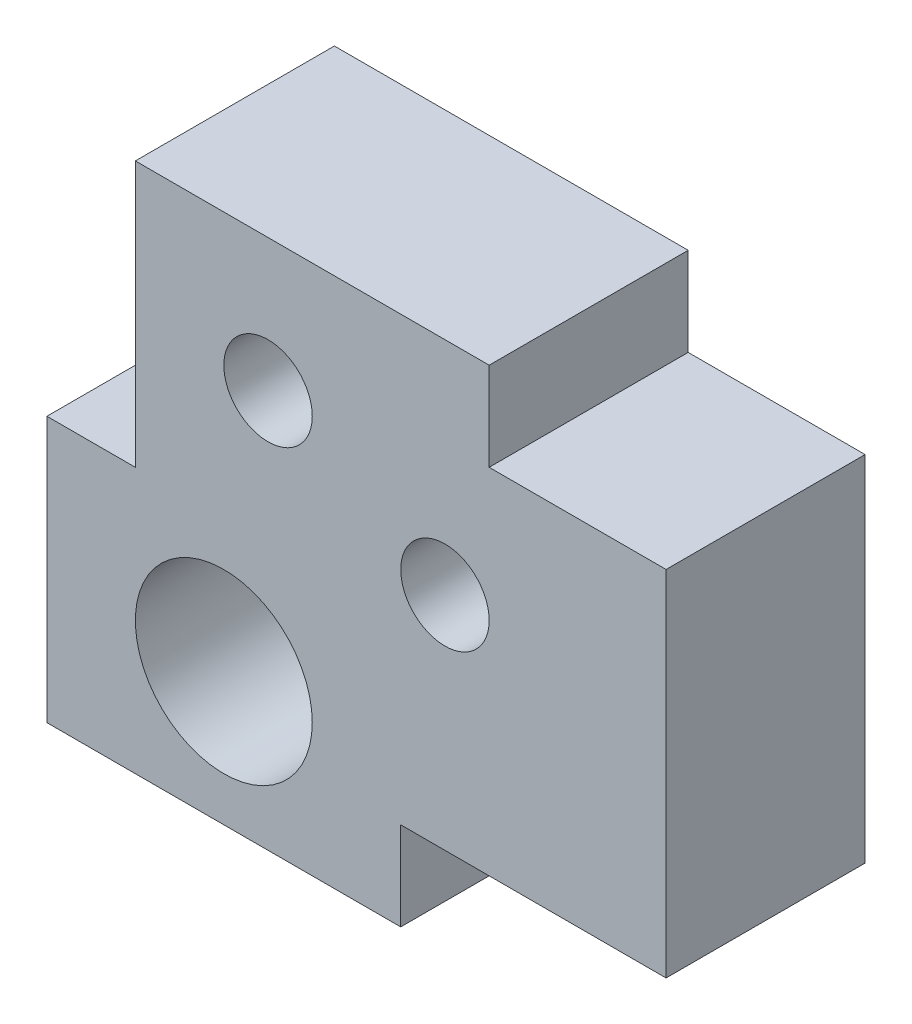
ISO-10303-21;
HEADER;
FILE_DESCRIPTION(('STEP AP214'),'2;1');
FILE_NAME('part.step','',(''),(''),'','','');
FILE_SCHEMA(('AUTOMOTIVE_DESIGN { 1 0 10303 214 1 1 1 1 }'));
ENDSEC;
DATA;
#1=APPLICATION_CONTEXT('core data for automotive mechanical design processes');
#2=APPLICATION_PROTOCOL_DEFINITION('international standard','automotive_design',2000,#1);
#3=PRODUCT_CONTEXT('',#1,'mechanical');
#4=PRODUCT('Part','Part','',(#3));
#5=PRODUCT_RELATED_PRODUCT_CATEGORY('part','',(#4));
#6=PRODUCT_DEFINITION_FORMATION('','',#4);
#7=PRODUCT_DEFINITION_CONTEXT('part definition',#1,'design');
#8=PRODUCT_DEFINITION('design','',#6,#7);
#9=PRODUCT_DEFINITION_SHAPE('','',#8);
#10=(LENGTH_UNIT() NAMED_UNIT(*) SI_UNIT(.MILLI.,.METRE.));
#11=(NAMED_UNIT(*) PLANE_ANGLE_UNIT() SI_UNIT($,.RADIAN.));
#12=(NAMED_UNIT(*) SI_UNIT($,.STERADIAN.) SOLID_ANGLE_UNIT());
#13=UNCERTAINTY_MEASURE_WITH_UNIT(LENGTH_MEASURE(1.E-05),#10,'distance_accuracy_value','');
#14=(GEOMETRIC_REPRESENTATION_CONTEXT(3) GLOBAL_UNCERTAINTY_ASSIGNED_CONTEXT((#13)) GLOBAL_UNIT_ASSIGNED_CONTEXT((#10,
#11,#12)) REPRESENTATION_CONTEXT('',''));
#15=CARTESIAN_POINT('',(0.,0.,0.));
#16=DIRECTION('',(0.,0.,1.));
#17=DIRECTION('',(1.,0.,0.));
#18=AXIS2_PLACEMENT_3D('',#15,#16,#17);
#19=CARTESIAN_POINT('',(0.,0.,28.575));
#20=DIRECTION('',(0.,0.,-1.));
#21=DIRECTION('',(-1.,0.,0.));
#22=AXIS2_PLACEMENT_3D('',#19,#20,#21);
#23=PLANE('',#22);
#24=DIRECTION('',(0.,-1.,0.));
#25=VECTOR('',#24,1.);
#26=CARTESIAN_POINT('',(-12.5135326887395,0.,28.575));
#27=LINE('',#26,#25);
#28=CARTESIAN_POINT('',(-12.5135326887395,38.1,28.575));
#29=VERTEX_POINT('',#28);
#30=CARTESIAN_POINT('',(-12.5135326887395,0.,28.575));
#31=VERTEX_POINT('',#30);
#32=EDGE_CURVE('E197',#29,#31,#27,.T.);
#33=ORIENTED_EDGE('',*,*,#32,.T.);
#34=DIRECTION('',(-1.,0.,0.));
#35=VECTOR('',#34,1.);
#36=CARTESIAN_POINT('',(-12.5135326887395,0.,28.575));
#37=LINE('',#36,#35);
#38=CARTESIAN_POINT('',(-25.2135326887395,0.,28.575));
#39=VERTEX_POINT('',#38);
#40=EDGE_CURVE('E120',#31,#39,#37,.T.);
#41=ORIENTED_EDGE('',*,*,#40,.T.);
#42=DIRECTION('',(0.,-1.,0.));
#43=VECTOR('',#42,1.);
#44=CARTESIAN_POINT('',(-25.2135326887395,0.,28.575));
#45=LINE('',#44,#43);
#46=CARTESIAN_POINT('',(-25.2135326887395,-38.1,28.575));
#47=VERTEX_POINT('',#46);
#48=EDGE_CURVE('E227',#39,#47,#45,.T.);
#49=ORIENTED_EDGE('',*,*,#48,.T.);
#50=DIRECTION('',(1.,0.,0.));
#51=VECTOR('',#50,1.);
#52=CARTESIAN_POINT('',(-25.2135326887395,-38.1,28.575));
#53=LINE('',#52,#51);
#54=CARTESIAN_POINT('',(25.5864673112605,-38.1,28.575));
#55=VERTEX_POINT('',#54);
#56=EDGE_CURVE('E247',#47,#55,#53,.T.);
#57=ORIENTED_EDGE('',*,*,#56,.T.);
#58=DIRECTION('',(0.,1.,0.));
#59=VECTOR('',#58,1.);
#60=CARTESIAN_POINT('',(25.5864673112605,-38.1,28.575));
#61=LINE('',#60,#59);
#62=CARTESIAN_POINT('',(25.5864673112605,-25.4,28.575));
#63=VERTEX_POINT('',#62);
#64=EDGE_CURVE('E243',#55,#63,#61,.T.);
#65=ORIENTED_EDGE('',*,*,#64,.T.);
#66=DIRECTION('',(1.,0.,0.));
#67=VECTOR('',#66,1.);
#68=CARTESIAN_POINT('',(63.6864673112605,-25.4,28.575));
#69=LINE('',#68,#67);
#70=CARTESIAN_POINT('',(63.6864673112605,-25.4,28.575));
#71=VERTEX_POINT('',#70);
#72=EDGE_CURVE('E246',#63,#71,#69,.T.);
#73=ORIENTED_EDGE('',*,*,#72,.T.);
#74=DIRECTION('',(0.,1.,0.));
#75=VECTOR('',#74,1.);
#76=CARTESIAN_POINT('',(63.6864673112605,25.4,28.575));
#77=LINE('',#76,#75);
#78=CARTESIAN_POINT('',(63.6864673112605,25.4,28.575));
#79=VERTEX_POINT('',#78);
#80=EDGE_CURVE('E145',#71,#79,#77,.T.);
#81=ORIENTED_EDGE('',*,*,#80,.T.);
#82=DIRECTION('',(-1.,0.,0.));
#83=VECTOR('',#82,1.);
#84=CARTESIAN_POINT('',(38.2864673112605,25.4,28.575));
#85=LINE('',#84,#83);
#86=CARTESIAN_POINT('',(38.2864673112605,25.4,28.575));
#87=VERTEX_POINT('',#86);
#88=EDGE_CURVE('E139',#79,#87,#85,.T.);
#89=ORIENTED_EDGE('',*,*,#88,.T.);
#90=DIRECTION('',(0.,1.,0.));
#91=VECTOR('',#90,1.);
#92=CARTESIAN_POINT('',(38.2864673112605,38.1,28.575));
#93=LINE('',#92,#91);
#94=CARTESIAN_POINT('',(38.2864673112605,38.1,28.575));
#95=VERTEX_POINT('',#94);
#96=EDGE_CURVE('E143',#87,#95,#93,.T.);
#97=ORIENTED_EDGE('',*,*,#96,.T.);
#98=DIRECTION('',(-1.,0.,0.));
#99=VECTOR('',#98,1.);
#100=CARTESIAN_POINT('',(-12.5135326887395,38.1,28.575));
#101=LINE('',#100,#99);
#102=EDGE_CURVE('E71',#95,#29,#101,.T.);
#103=ORIENTED_EDGE('',*,*,#102,.T.);
#104=EDGE_LOOP('',(#33,#41,#49,#57,#65,#73,#81,#89,#97,#103));
#105=FACE_BOUND('',#104,.T.);
#106=CARTESIAN_POINT('',(6.53646731126052,19.05,28.575));
#107=DIRECTION('',(0.,0.,1.));
#108=DIRECTION('',(1.,0.,0.));
#109=AXIS2_PLACEMENT_3D('',#106,#107,#108);
#110=CIRCLE('',#109,6.35);
#111=CARTESIAN_POINT('',(12.8864673112605,19.05,28.575));
#112=VERTEX_POINT('',#111);
#113=EDGE_CURVE('E173',#112,#112,#110,.T.);
#114=ORIENTED_EDGE('',*,*,#113,.F.);
#115=EDGE_LOOP('',(#114));
#116=FACE_BOUND('',#115,.T.);
#117=CARTESIAN_POINT('',(31.9364673112605,6.35,28.575));
#118=DIRECTION('',(0.,0.,1.));
#119=DIRECTION('',(1.,0.,0.));
#120=AXIS2_PLACEMENT_3D('',#117,#118,#119);
#121=CIRCLE('',#120,6.35);
#122=CARTESIAN_POINT('',(38.2864673112605,6.35,28.575));
#123=VERTEX_POINT('',#122);
#124=EDGE_CURVE('E269',#123,#123,#121,.T.);
#125=ORIENTED_EDGE('',*,*,#124,.F.);
#126=EDGE_LOOP('',(#125));
#127=FACE_BOUND('',#126,.T.);
#128=CARTESIAN_POINT('',(0.186467311260523,-19.05,28.575));
#129=DIRECTION('',(0.,0.,1.));
#130=DIRECTION('',(1.,0.,0.));
#131=AXIS2_PLACEMENT_3D('',#128,#129,#130);
#132=CIRCLE('',#131,12.7);
#133=CARTESIAN_POINT('',(12.8864673112605,-19.05,28.575));
#134=VERTEX_POINT('',#133);
#135=EDGE_CURVE('E277',#134,#134,#132,.T.);
#136=ORIENTED_EDGE('',*,*,#135,.F.);
#137=EDGE_LOOP('',(#136));
#138=FACE_BOUND('',#137,.T.);
#139=ADVANCED_FACE('F53',(#105,#116,#127,#138),#23,.F.);
#140=CARTESIAN_POINT('',(0.,0.,0.));
#141=DIRECTION('',(0.,0.,-1.));
#142=DIRECTION('',(-1.,0.,0.));
#143=AXIS2_PLACEMENT_3D('',#140,#141,#142);
#144=PLANE('',#143);
#145=CARTESIAN_POINT('',(31.9364673112605,6.35,0.));
#146=DIRECTION('',(0.,0.,1.));
#147=DIRECTION('',(1.,0.,0.));
#148=AXIS2_PLACEMENT_3D('',#145,#146,#147);
#149=CIRCLE('',#148,6.35);
#150=CARTESIAN_POINT('',(38.2864673112605,6.35,0.));
#151=VERTEX_POINT('',#150);
#152=EDGE_CURVE('E273',#151,#151,#149,.T.);
#153=ORIENTED_EDGE('',*,*,#152,.T.);
#154=EDGE_LOOP('',(#153));
#155=FACE_BOUND('',#154,.T.);
#156=DIRECTION('',(0.,-1.,0.));
#157=VECTOR('',#156,1.);
#158=CARTESIAN_POINT('',(-12.5135326887395,0.,0.));
#159=LINE('',#158,#157);
#160=CARTESIAN_POINT('',(-12.5135326887395,38.1,0.));
#161=VERTEX_POINT('',#160);
#162=CARTESIAN_POINT('',(-12.5135326887395,0.,0.));
#163=VERTEX_POINT('',#162);
#164=EDGE_CURVE('E168',#161,#163,#159,.T.);
#165=ORIENTED_EDGE('',*,*,#164,.F.);
#166=DIRECTION('',(-1.,0.,0.));
#167=VECTOR('',#166,1.);
#168=CARTESIAN_POINT('',(-12.5135326887395,38.1,0.));
#169=LINE('',#168,#167);
#170=CARTESIAN_POINT('',(38.2864673112605,38.1,0.));
#171=VERTEX_POINT('',#170);
#172=EDGE_CURVE('E112',#171,#161,#169,.T.);
#173=ORIENTED_EDGE('',*,*,#172,.F.);
#174=DIRECTION('',(0.,1.,0.));
#175=VECTOR('',#174,1.);
#176=CARTESIAN_POINT('',(38.2864673112605,38.1,0.));
#177=LINE('',#176,#175);
#178=CARTESIAN_POINT('',(38.2864673112605,25.4,0.));
#179=VERTEX_POINT('',#178);
#180=EDGE_CURVE('E106',#179,#171,#177,.T.);
#181=ORIENTED_EDGE('',*,*,#180,.F.);
#182=DIRECTION('',(-1.,0.,0.));
#183=VECTOR('',#182,1.);
#184=CARTESIAN_POINT('',(38.2864673112605,25.4,0.));
#185=LINE('',#184,#183);
#186=CARTESIAN_POINT('',(63.6864673112605,25.4,0.));
#187=VERTEX_POINT('',#186);
#188=EDGE_CURVE('E154',#187,#179,#185,.T.);
#189=ORIENTED_EDGE('',*,*,#188,.F.);
#190=DIRECTION('',(0.,1.,0.));
#191=VECTOR('',#190,1.);
#192=CARTESIAN_POINT('',(63.6864673112605,25.4,0.));
#193=LINE('',#192,#191);
#194=CARTESIAN_POINT('',(63.6864673112605,-25.4,0.));
#195=VERTEX_POINT('',#194);
#196=EDGE_CURVE('E188',#195,#187,#193,.T.);
#197=ORIENTED_EDGE('',*,*,#196,.F.);
#198=DIRECTION('',(1.,0.,0.));
#199=VECTOR('',#198,1.);
#200=CARTESIAN_POINT('',(63.6864673112605,-25.4,0.));
#201=LINE('',#200,#199);
#202=CARTESIAN_POINT('',(25.5864673112605,-25.4,0.));
#203=VERTEX_POINT('',#202);
#204=EDGE_CURVE('E185',#203,#195,#201,.T.);
#205=ORIENTED_EDGE('',*,*,#204,.F.);
#206=DIRECTION('',(0.,1.,0.));
#207=VECTOR('',#206,1.);
#208=CARTESIAN_POINT('',(25.5864673112605,-38.1,0.));
#209=LINE('',#208,#207);
#210=CARTESIAN_POINT('',(25.5864673112605,-38.1,0.));
#211=VERTEX_POINT('',#210);
#212=EDGE_CURVE('E182',#211,#203,#209,.T.);
#213=ORIENTED_EDGE('',*,*,#212,.F.);
#214=DIRECTION('',(1.,0.,0.));
#215=VECTOR('',#214,1.);
#216=CARTESIAN_POINT('',(-25.2135326887395,-38.1,0.));
#217=LINE('',#216,#215);
#218=CARTESIAN_POINT('',(-25.2135326887395,-38.1,0.));
#219=VERTEX_POINT('',#218);
#220=EDGE_CURVE('E179',#219,#211,#217,.T.);
#221=ORIENTED_EDGE('',*,*,#220,.F.);
#222=DIRECTION('',(0.,-1.,0.));
#223=VECTOR('',#222,1.);
#224=CARTESIAN_POINT('',(-25.2135326887395,0.,0.));
#225=LINE('',#224,#223);
#226=CARTESIAN_POINT('',(-25.2135326887395,0.,0.));
#227=VERTEX_POINT('',#226);
#228=EDGE_CURVE('E176',#227,#219,#225,.T.);
#229=ORIENTED_EDGE('',*,*,#228,.F.);
#230=DIRECTION('',(-1.,0.,0.));
#231=VECTOR('',#230,1.);
#232=CARTESIAN_POINT('',(-12.5135326887395,0.,0.));
#233=LINE('',#232,#231);
#234=EDGE_CURVE('E172',#163,#227,#233,.T.);
#235=ORIENTED_EDGE('',*,*,#234,.F.);
#236=EDGE_LOOP('',(#165,#173,#181,#189,#197,#205,#213,#221,#229,#235));
#237=FACE_BOUND('',#236,.T.);
#238=CARTESIAN_POINT('',(6.53646731126052,19.05,0.));
#239=DIRECTION('',(0.,0.,1.));
#240=DIRECTION('',(1.,0.,0.));
#241=AXIS2_PLACEMENT_3D('',#238,#239,#240);
#242=CIRCLE('',#241,6.35);
#243=CARTESIAN_POINT('',(12.8864673112605,19.05,0.));
#244=VERTEX_POINT('',#243);
#245=EDGE_CURVE('E265',#244,#244,#242,.T.);
#246=ORIENTED_EDGE('',*,*,#245,.T.);
#247=EDGE_LOOP('',(#246));
#248=FACE_BOUND('',#247,.T.);
#249=CARTESIAN_POINT('',(0.186467311260523,-19.05,0.));
#250=DIRECTION('',(0.,0.,1.));
#251=DIRECTION('',(1.,0.,0.));
#252=AXIS2_PLACEMENT_3D('',#249,#250,#251);
#253=CIRCLE('',#252,12.7);
#254=CARTESIAN_POINT('',(12.8864673112605,-19.05,0.));
#255=VERTEX_POINT('',#254);
#256=EDGE_CURVE('E281',#255,#255,#253,.T.);
#257=ORIENTED_EDGE('',*,*,#256,.T.);
#258=EDGE_LOOP('',(#257));
#259=FACE_BOUND('',#258,.T.);
#260=ADVANCED_FACE('F231',(#155,#237,#248,#259),#144,.T.);
#261=CARTESIAN_POINT('',(-12.5135326887395,0.,28.575));
#262=DIRECTION('',(1.,0.,0.));
#263=DIRECTION('',(0.,0.,-1.));
#264=AXIS2_PLACEMENT_3D('',#261,#262,#263);
#265=PLANE('',#264);
#266=ORIENTED_EDGE('',*,*,#164,.T.);
#267=DIRECTION('',(0.,0.,-1.));
#268=VECTOR('',#267,1.);
#269=CARTESIAN_POINT('',(-12.5135326887395,0.,28.575));
#270=LINE('',#269,#268);
#271=EDGE_CURVE('E13',#31,#163,#270,.T.);
#272=ORIENTED_EDGE('',*,*,#271,.F.);
#273=ORIENTED_EDGE('',*,*,#32,.F.);
#274=DIRECTION('',(0.,0.,-1.));
#275=VECTOR('',#274,1.);
#276=CARTESIAN_POINT('',(-12.5135326887395,38.1,28.575));
#277=LINE('',#276,#275);
#278=EDGE_CURVE('E164',#29,#161,#277,.T.);
#279=ORIENTED_EDGE('',*,*,#278,.T.);
#280=EDGE_LOOP('',(#266,#272,#273,#279));
#281=FACE_BOUND('',#280,.T.);
#282=ADVANCED_FACE('F55',(#281),#265,.F.);
#283=CARTESIAN_POINT('',(-12.5135326887395,0.,28.575));
#284=DIRECTION('',(0.,-1.,0.));
#285=DIRECTION('',(1.,0.,0.));
#286=AXIS2_PLACEMENT_3D('',#283,#284,#285);
#287=PLANE('',#286);
#288=ORIENTED_EDGE('',*,*,#234,.T.);
#289=DIRECTION('',(0.,0.,-1.));
#290=VECTOR('',#289,1.);
#291=CARTESIAN_POINT('',(-25.2135326887395,0.,28.575));
#292=LINE('',#291,#290);
#293=EDGE_CURVE('E63',#39,#227,#292,.T.);
#294=ORIENTED_EDGE('',*,*,#293,.F.);
#295=ORIENTED_EDGE('',*,*,#40,.F.);
#296=ORIENTED_EDGE('',*,*,#271,.T.);
#297=EDGE_LOOP('',(#288,#294,#295,#296));
#298=FACE_BOUND('',#297,.T.);
#299=ADVANCED_FACE('F324',(#298),#287,.F.);
#300=CARTESIAN_POINT('',(-25.2135326887395,0.,28.575));
#301=DIRECTION('',(1.,0.,0.));
#302=DIRECTION('',(0.,1.,0.));
#303=AXIS2_PLACEMENT_3D('',#300,#301,#302);
#304=PLANE('',#303);
#305=ORIENTED_EDGE('',*,*,#228,.T.);
#306=DIRECTION('',(0.,0.,-1.));
#307=VECTOR('',#306,1.);
#308=CARTESIAN_POINT('',(-25.2135326887395,-38.1,28.575));
#309=LINE('',#308,#307);
#310=EDGE_CURVE('E216',#47,#219,#309,.T.);
#311=ORIENTED_EDGE('',*,*,#310,.F.);
#312=ORIENTED_EDGE('',*,*,#48,.F.);
#313=ORIENTED_EDGE('',*,*,#293,.T.);
#314=EDGE_LOOP('',(#305,#311,#312,#313));
#315=FACE_BOUND('',#314,.T.);
#316=ADVANCED_FACE('F225',(#315),#304,.F.);
#317=CARTESIAN_POINT('',(-25.2135326887395,-38.1,28.575));
#318=DIRECTION('',(0.,1.,0.));
#319=DIRECTION('',(0.,0.,1.));
#320=AXIS2_PLACEMENT_3D('',#317,#318,#319);
#321=PLANE('',#320);
#322=ORIENTED_EDGE('',*,*,#220,.T.);
#323=DIRECTION('',(0.,0.,-1.));
#324=VECTOR('',#323,1.);
#325=CARTESIAN_POINT('',(25.5864673112605,-38.1,28.575));
#326=LINE('',#325,#324);
#327=EDGE_CURVE('E212',#55,#211,#326,.T.);
#328=ORIENTED_EDGE('',*,*,#327,.F.);
#329=ORIENTED_EDGE('',*,*,#56,.F.);
#330=ORIENTED_EDGE('',*,*,#310,.T.);
#331=EDGE_LOOP('',(#322,#328,#329,#330));
#332=FACE_BOUND('',#331,.T.);
#333=ADVANCED_FACE('F237',(#332),#321,.F.);
#334=CARTESIAN_POINT('',(25.5864673112605,-38.1,28.575));
#335=DIRECTION('',(-1.,0.,0.));
#336=DIRECTION('',(0.,0.,1.));
#337=AXIS2_PLACEMENT_3D('',#334,#335,#336);
#338=PLANE('',#337);
#339=ORIENTED_EDGE('',*,*,#212,.T.);
#340=DIRECTION('',(0.,0.,-1.));
#341=VECTOR('',#340,1.);
#342=CARTESIAN_POINT('',(25.5864673112605,-25.4,28.575));
#343=LINE('',#342,#341);
#344=EDGE_CURVE('E208',#63,#203,#343,.T.);
#345=ORIENTED_EDGE('',*,*,#344,.F.);
#346=ORIENTED_EDGE('',*,*,#64,.F.);
#347=ORIENTED_EDGE('',*,*,#327,.T.);
#348=EDGE_LOOP('',(#339,#345,#346,#347));
#349=FACE_BOUND('',#348,.T.);
#350=ADVANCED_FACE('F241',(#349),#338,.F.);
#351=CARTESIAN_POINT('',(63.6864673112605,-25.4,28.575));
#352=DIRECTION('',(0.,1.,0.));
#353=DIRECTION('',(-1.,0.,0.));
#354=AXIS2_PLACEMENT_3D('',#351,#352,#353);
#355=PLANE('',#354);
#356=ORIENTED_EDGE('',*,*,#204,.T.);
#357=DIRECTION('',(0.,0.,-1.));
#358=VECTOR('',#357,1.);
#359=CARTESIAN_POINT('',(63.6864673112605,-25.4,28.575));
#360=LINE('',#359,#358);
#361=EDGE_CURVE('E204',#71,#195,#360,.T.);
#362=ORIENTED_EDGE('',*,*,#361,.F.);
#363=ORIENTED_EDGE('',*,*,#72,.F.);
#364=ORIENTED_EDGE('',*,*,#344,.T.);
#365=EDGE_LOOP('',(#356,#362,#363,#364));
#366=FACE_BOUND('',#365,.T.);
#367=ADVANCED_FACE('F314',(#366),#355,.F.);
#368=CARTESIAN_POINT('',(63.6864673112605,25.4,28.575));
#369=DIRECTION('',(-1.,0.,0.));
#370=DIRECTION('',(0.,0.,1.));
#371=AXIS2_PLACEMENT_3D('',#368,#369,#370);
#372=PLANE('',#371);
#373=ORIENTED_EDGE('',*,*,#196,.T.);
#374=DIRECTION('',(0.,0.,-1.));
#375=VECTOR('',#374,1.);
#376=CARTESIAN_POINT('',(63.6864673112605,25.4,28.575));
#377=LINE('',#376,#375);
#378=EDGE_CURVE('E156',#79,#187,#377,.T.);
#379=ORIENTED_EDGE('',*,*,#378,.F.);
#380=ORIENTED_EDGE('',*,*,#80,.F.);
#381=ORIENTED_EDGE('',*,*,#361,.T.);
#382=EDGE_LOOP('',(#373,#379,#380,#381));
#383=FACE_BOUND('',#382,.T.);
#384=ADVANCED_FACE('F311',(#383),#372,.F.);
#385=CARTESIAN_POINT('',(38.2864673112605,25.4,28.575));
#386=DIRECTION('',(0.,-1.,0.));
#387=DIRECTION('',(0.,0.,-1.));
#388=AXIS2_PLACEMENT_3D('',#385,#386,#387);
#389=PLANE('',#388);
#390=ORIENTED_EDGE('',*,*,#188,.T.);
#391=DIRECTION('',(0.,0.,-1.));
#392=VECTOR('',#391,1.);
#393=CARTESIAN_POINT('',(38.2864673112605,25.4,28.575));
#394=LINE('',#393,#392);
#395=EDGE_CURVE('E151',#87,#179,#394,.T.);
#396=ORIENTED_EDGE('',*,*,#395,.F.);
#397=ORIENTED_EDGE('',*,*,#88,.F.);
#398=ORIENTED_EDGE('',*,*,#378,.T.);
#399=EDGE_LOOP('',(#390,#396,#397,#398));
#400=FACE_BOUND('',#399,.T.);
#401=ADVANCED_FACE('F152',(#400),#389,.F.);
#402=CARTESIAN_POINT('',(38.2864673112605,38.1,28.575));
#403=DIRECTION('',(-1.,0.,0.));
#404=DIRECTION('',(0.,0.,1.));
#405=AXIS2_PLACEMENT_3D('',#402,#403,#404);
#406=PLANE('',#405);
#407=ORIENTED_EDGE('',*,*,#180,.T.);
#408=DIRECTION('',(0.,0.,-1.));
#409=VECTOR('',#408,1.);
#410=CARTESIAN_POINT('',(38.2864673112605,38.1,28.575));
#411=LINE('',#410,#409);
#412=EDGE_CURVE('E157',#95,#171,#411,.T.);
#413=ORIENTED_EDGE('',*,*,#412,.F.);
#414=ORIENTED_EDGE('',*,*,#96,.F.);
#415=ORIENTED_EDGE('',*,*,#395,.T.);
#416=EDGE_LOOP('',(#407,#413,#414,#415));
#417=FACE_BOUND('',#416,.T.);
#418=ADVANCED_FACE('F159',(#417),#406,.F.);
#419=CARTESIAN_POINT('',(-12.5135326887395,38.1,28.575));
#420=DIRECTION('',(0.,-1.,0.));
#421=DIRECTION('',(0.,0.,-1.));
#422=AXIS2_PLACEMENT_3D('',#419,#420,#421);
#423=PLANE('',#422);
#424=ORIENTED_EDGE('',*,*,#172,.T.);
#425=ORIENTED_EDGE('',*,*,#278,.F.);
#426=ORIENTED_EDGE('',*,*,#102,.F.);
#427=ORIENTED_EDGE('',*,*,#412,.T.);
#428=EDGE_LOOP('',(#424,#425,#426,#427));
#429=FACE_BOUND('',#428,.T.);
#430=ADVANCED_FACE('F304',(#429),#423,.F.);
#431=CARTESIAN_POINT('',(6.53646731126052,19.05,28.575));
#432=DIRECTION('',(0.,0.,-1.));
#433=DIRECTION('',(-1.,0.,0.));
#434=AXIS2_PLACEMENT_3D('',#431,#432,#433);
#435=CYLINDRICAL_SURFACE('',#434,6.35);
#436=ORIENTED_EDGE('',*,*,#113,.T.);
#437=EDGE_LOOP('',(#436));
#438=FACE_BOUND('',#437,.T.);
#439=ORIENTED_EDGE('',*,*,#245,.F.);
#440=EDGE_LOOP('',(#439));
#441=FACE_BOUND('',#440,.T.);
#442=ADVANCED_FACE('F301',(#438,#441),#435,.F.);
#443=CARTESIAN_POINT('',(31.9364673112605,6.35,28.575));
#444=DIRECTION('',(0.,0.,-1.));
#445=DIRECTION('',(-1.,0.,0.));
#446=AXIS2_PLACEMENT_3D('',#443,#444,#445);
#447=CYLINDRICAL_SURFACE('',#446,6.35);
#448=ORIENTED_EDGE('',*,*,#124,.T.);
#449=EDGE_LOOP('',(#448));
#450=FACE_BOUND('',#449,.T.);
#451=ORIENTED_EDGE('',*,*,#152,.F.);
#452=EDGE_LOOP('',(#451));
#453=FACE_BOUND('',#452,.T.);
#454=ADVANCED_FACE('F415',(#450,#453),#447,.F.);
#455=CARTESIAN_POINT('',(0.186467311260523,-19.05,28.575));
#456=DIRECTION('',(0.,0.,-1.));
#457=DIRECTION('',(-1.,0.,0.));
#458=AXIS2_PLACEMENT_3D('',#455,#456,#457);
#459=CYLINDRICAL_SURFACE('',#458,12.7);
#460=ORIENTED_EDGE('',*,*,#135,.T.);
#461=EDGE_LOOP('',(#460));
#462=FACE_BOUND('',#461,.T.);
#463=ORIENTED_EDGE('',*,*,#256,.F.);
#464=EDGE_LOOP('',(#463));
#465=FACE_BOUND('',#464,.T.);
#466=ADVANCED_FACE('F290',(#462,#465),#459,.F.);
#467=CLOSED_SHELL('',(#139,#260,#282,#299,#316,#333,#350,#367,#384,#401,#418,#430,#442,#454,#466));
#468=MANIFOLD_SOLID_BREP('B2',#467);
#469=ADVANCED_BREP_SHAPE_REPRESENTATION('',(#18,#468),#14);
#470=SHAPE_DEFINITION_REPRESENTATION(#9,#469);
ENDSEC;
END-ISO-10303-21;
